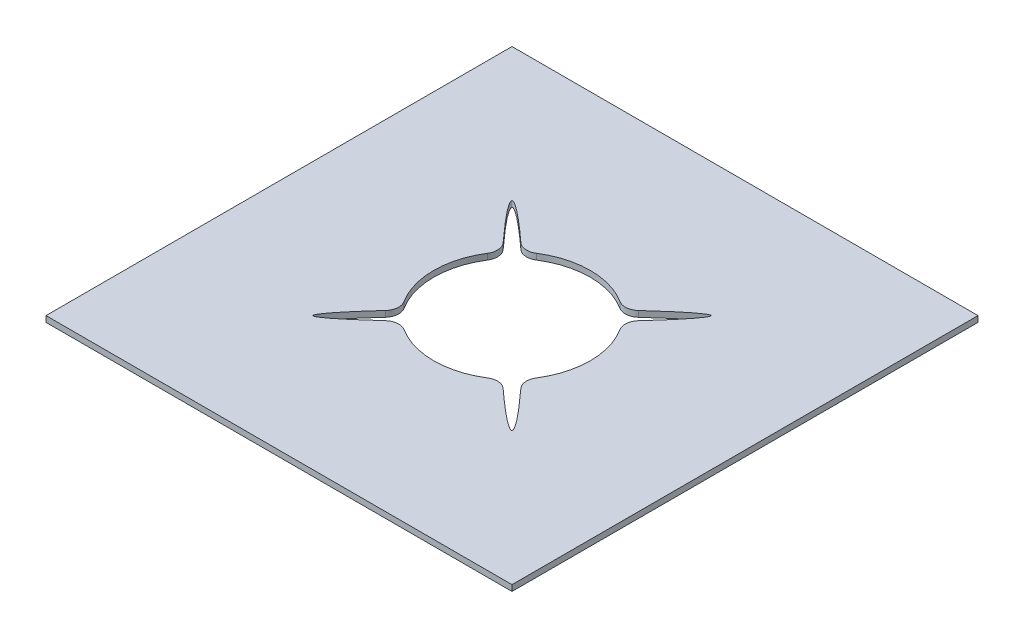
ISO-10303-21;
HEADER;
FILE_DESCRIPTION(('STEP AP214'),'2;1');
FILE_NAME('part.step','',(''),(''),'','','');
FILE_SCHEMA(('AUTOMOTIVE_DESIGN { 1 0 10303 214 1 1 1 1 }'));
ENDSEC;
DATA;
#1=APPLICATION_CONTEXT('core data for automotive mechanical design processes');
#2=APPLICATION_PROTOCOL_DEFINITION('international standard','automotive_design',2000,#1);
#3=PRODUCT_CONTEXT('',#1,'mechanical');
#4=PRODUCT('Part','Part','',(#3));
#5=PRODUCT_RELATED_PRODUCT_CATEGORY('part','',(#4));
#6=PRODUCT_DEFINITION_FORMATION('','',#4);
#7=PRODUCT_DEFINITION_CONTEXT('part definition',#1,'design');
#8=PRODUCT_DEFINITION('design','',#6,#7);
#9=PRODUCT_DEFINITION_SHAPE('','',#8);
#10=(LENGTH_UNIT() NAMED_UNIT(*) SI_UNIT(.MILLI.,.METRE.));
#11=(NAMED_UNIT(*) PLANE_ANGLE_UNIT() SI_UNIT($,.RADIAN.));
#12=(NAMED_UNIT(*) SI_UNIT($,.STERADIAN.) SOLID_ANGLE_UNIT());
#13=UNCERTAINTY_MEASURE_WITH_UNIT(LENGTH_MEASURE(1.E-05),#10,'distance_accuracy_value','');
#14=(GEOMETRIC_REPRESENTATION_CONTEXT(3) GLOBAL_UNCERTAINTY_ASSIGNED_CONTEXT((#13)) GLOBAL_UNIT_ASSIGNED_CONTEXT((#10,
#11,#12)) REPRESENTATION_CONTEXT('',''));
#15=CARTESIAN_POINT('',(0.,0.,0.));
#16=DIRECTION('',(0.,0.,1.));
#17=DIRECTION('',(1.,0.,0.));
#18=AXIS2_PLACEMENT_3D('',#15,#16,#17);
#19=CARTESIAN_POINT('',(0.,6.35,0.));
#20=DIRECTION('',(0.,1.,0.));
#21=DIRECTION('',(0.,0.,1.));
#22=AXIS2_PLACEMENT_3D('',#19,#20,#21);
#23=PLANE('',#22);
#24=DIRECTION('',(0.,0.,1.));
#25=VECTOR('',#24,1.);
#26=CARTESIAN_POINT('',(-229.838709677419,6.35,-211.693548387097));
#27=LINE('',#26,#25);
#28=CARTESIAN_POINT('',(-229.838709677419,6.35,-211.693548387097));
#29=VERTEX_POINT('',#28);
#30=CARTESIAN_POINT('',(-229.838709677419,6.35,288.306451612903));
#31=VERTEX_POINT('',#30);
#32=EDGE_CURVE('E184',#29,#31,#27,.T.);
#33=ORIENTED_EDGE('',*,*,#32,.T.);
#34=DIRECTION('',(1.,0.,0.));
#35=VECTOR('',#34,1.);
#36=CARTESIAN_POINT('',(-229.838709677419,6.35,288.306451612903));
#37=LINE('',#36,#35);
#38=CARTESIAN_POINT('',(270.161290322581,6.35,288.306451612903));
#39=VERTEX_POINT('',#38);
#40=EDGE_CURVE('E173',#31,#39,#37,.T.);
#41=ORIENTED_EDGE('',*,*,#40,.T.);
#42=DIRECTION('',(0.,0.,-1.));
#43=VECTOR('',#42,1.);
#44=CARTESIAN_POINT('',(270.161290322581,6.35,-211.693548387097));
#45=LINE('',#44,#43);
#46=CARTESIAN_POINT('',(270.161290322581,6.35,-211.693548387097));
#47=VERTEX_POINT('',#46);
#48=EDGE_CURVE('E183',#39,#47,#45,.T.);
#49=ORIENTED_EDGE('',*,*,#48,.T.);
#50=DIRECTION('',(-1.,0.,0.));
#51=VECTOR('',#50,1.);
#52=CARTESIAN_POINT('',(-229.838709677419,6.35,-211.693548387097));
#53=LINE('',#52,#51);
#54=EDGE_CURVE('E189',#47,#29,#53,.T.);
#55=ORIENTED_EDGE('',*,*,#54,.T.);
#56=EDGE_LOOP('',(#33,#41,#49,#55));
#57=FACE_BOUND('',#56,.T.);
#58=CARTESIAN_POINT('',(-27.581013578485,6.35,96.6289112448538));
#59=CARTESIAN_POINT('',(-209.618135509777,6.35,268.146429603046));
#60=CARTESIAN_POINT('',(-38.1888727476117,6.35,86.0235671274771));
#61=(BOUNDED_CURVE() B_SPLINE_CURVE(2,(#58,#59,#60),.UNSPECIFIED.,.F.,
.F.) B_SPLINE_CURVE_WITH_KNOTS((3,3),(0.,1.),
.UNSPECIFIED.) CURVE() GEOMETRIC_REPRESENTATION_ITEM() RATIONAL_B_SPLINE_CURVE((1.,
0.436781609195402,1.)) REPRESENTATION_ITEM(''));
#62=CARTESIAN_POINT('',(-42.920621280957,6.35,110.873493927421));
#63=VERTEX_POINT('',#62);
#64=CARTESIAN_POINT('',(-52.41596542798,6.35,101.35928096381));
#65=VERTEX_POINT('',#64);
#66=EDGE_CURVE('E425',#63,#65,#61,.T.);
#67=ORIENTED_EDGE('',*,*,#66,.T.);
#68=CARTESIAN_POINT('',(-63.4946699714491,6.35,91.2467982993737));
#69=DIRECTION('',(0.,1.,0.));
#70=DIRECTION('',(0.,0.,1.));
#71=AXIS2_PLACEMENT_3D('',#68,#69,#70);
#72=CIRCLE('',#71,15.);
#73=CARTESIAN_POINT('',(-50.8195244723537,6.35,83.2255336499085));
#74=VERTEX_POINT('',#73);
#75=EDGE_CURVE('E223',#65,#74,#72,.T.);
#76=ORIENTED_EDGE('',*,*,#75,.T.);
#77=CARTESIAN_POINT('',(20.1612903225808,6.35,38.3064516129032));
#78=DIRECTION('',(0.,1.,0.));
#79=DIRECTION('',(0.,0.,1.));
#80=AXIS2_PLACEMENT_3D('',#77,#78,#79);
#81=CIRCLE('',#80,84.);
#82=CARTESIAN_POINT('',(-50.8067505458124,6.35,-6.63280934343732));
#83=VERTEX_POINT('',#82);
#84=EDGE_CURVE('E390',#83,#74,#81,.T.);
#85=ORIENTED_EDGE('',*,*,#84,.F.);
#86=CARTESIAN_POINT('',(-63.4796149865969,6.35,-14.6576773713553));
#87=DIRECTION('',(0.,1.,0.));
#88=DIRECTION('',(0.,0.,1.));
#89=AXIS2_PLACEMENT_3D('',#86,#87,#88);
#90=CIRCLE('',#89,15.);
#91=CARTESIAN_POINT('',(-52.4057513660394,6.35,-24.775460948468));
#92=VERTEX_POINT('',#91);
#93=EDGE_CURVE('E215',#83,#92,#90,.T.);
#94=ORIENTED_EDGE('',*,*,#93,.T.);
#95=CARTESIAN_POINT('',(-38.1611678084991,6.35,-9.43585228834221));
#96=CARTESIAN_POINT('',(-209.67868616669,6.35,-191.472974219635));
#97=CARTESIAN_POINT('',(-27.5558236911224,6.35,-20.0437114574688));
#98=(BOUNDED_CURVE() B_SPLINE_CURVE(2,(#95,#96,#97),.UNSPECIFIED.,.F.,
.F.) B_SPLINE_CURVE_WITH_KNOTS((3,3),(0.,1.),
.UNSPECIFIED.) CURVE() GEOMETRIC_REPRESENTATION_ITEM() RATIONAL_B_SPLINE_CURVE((1.,
0.436781609195402,1.)) REPRESENTATION_ITEM(''));
#99=CARTESIAN_POINT('',(-42.8915381339252,6.35,-34.2708046914146));
#100=VERTEX_POINT('',#99);
#101=EDGE_CURVE('E420',#92,#100,#98,.T.);
#102=ORIENTED_EDGE('',*,*,#101,.T.);
#103=CARTESIAN_POINT('',(-32.779055477415,6.35,-45.3495092421182));
#104=DIRECTION('',(0.,1.,0.));
#105=DIRECTION('',(0.,0.,1.));
#106=AXIS2_PLACEMENT_3D('',#103,#104,#105);
#107=CIRCLE('',#106,15.);
#108=CARTESIAN_POINT('',(-24.7577909622641,6.35,-32.6743636580241));
#109=VERTEX_POINT('',#108);
#110=EDGE_CURVE('E213',#100,#109,#107,.T.);
#111=ORIENTED_EDGE('',*,*,#110,.T.);
#112=CARTESIAN_POINT('',(65.1005520309861,6.35,-32.6615887792583));
#113=VERTEX_POINT('',#112);
#114=EDGE_CURVE('E386',#113,#109,#81,.T.);
#115=ORIENTED_EDGE('',*,*,#114,.F.);
#116=CARTESIAN_POINT('',(73.1254201932013,6.35,-45.3344531350014));
#117=DIRECTION('',(0.,1.,0.));
#118=DIRECTION('',(0.,0.,1.));
#119=AXIS2_PLACEMENT_3D('',#116,#117,#118);
#120=CIRCLE('',#119,15.);
#121=CARTESIAN_POINT('',(83.243203778244,6.35,-34.2605895216892));
#122=VERTEX_POINT('',#121);
#123=EDGE_CURVE('E211',#113,#122,#120,.T.);
#124=ORIENTED_EDGE('',*,*,#123,.T.);
#125=CARTESIAN_POINT('',(67.9035957246961,6.35,-20.0160065183566));
#126=CARTESIAN_POINT('',(249.940717655987,6.35,-191.53352487655));
#127=CARTESIAN_POINT('',(78.5114548938229,6.35,-9.41066240098003));
#128=(BOUNDED_CURVE() B_SPLINE_CURVE(2,(#125,#126,#127),.UNSPECIFIED.,.F.,
.F.) B_SPLINE_CURVE_WITH_KNOTS((3,3),(0.,1.),
.UNSPECIFIED.) CURVE() GEOMETRIC_REPRESENTATION_ITEM() RATIONAL_B_SPLINE_CURVE((1.,
0.436781609195402,1.)) REPRESENTATION_ITEM(''));
#129=CARTESIAN_POINT('',(92.738547252778,6.35,-24.7463758851894));
#130=VERTEX_POINT('',#129);
#131=EDGE_CURVE('E273',#122,#130,#128,.T.);
#132=ORIENTED_EDGE('',*,*,#131,.T.);
#133=CARTESIAN_POINT('',(103.817251792047,6.35,-14.6338932161517));
#134=DIRECTION('',(0.,1.,0.));
#135=DIRECTION('',(0.,0.,1.));
#136=AXIS2_PLACEMENT_3D('',#133,#134,#135);
#137=CIRCLE('',#136,15.);
#138=CARTESIAN_POINT('',(91.1421061148549,6.35,-6.61262884811308));
#139=VERTEX_POINT('',#138);
#140=EDGE_CURVE('E209',#130,#139,#137,.T.);
#141=ORIENTED_EDGE('',*,*,#140,.T.);
#142=CARTESIAN_POINT('',(91.129331236101,6.35,83.2457124979792));
#143=VERTEX_POINT('',#142);
#144=EDGE_CURVE('E383',#143,#139,#81,.T.);
#145=ORIENTED_EDGE('',*,*,#144,.F.);
#146=CARTESIAN_POINT('',(103.802195684944,6.35,91.2705805131713));
#147=DIRECTION('',(0.,1.,0.));
#148=DIRECTION('',(0.,0.,1.));
#149=AXIS2_PLACEMENT_3D('',#146,#147,#148);
#150=CIRCLE('',#149,15.);
#151=CARTESIAN_POINT('',(92.7283320830704,6.35,101.388364110734));
#152=VERTEX_POINT('',#151);
#153=EDGE_CURVE('E217',#143,#152,#150,.T.);
#154=ORIENTED_EDGE('',*,*,#153,.T.);
#155=CARTESIAN_POINT('',(78.4837499547109,6.35,86.0487570148393));
#156=CARTESIAN_POINT('',(250.001268312903,6.35,268.085878946131));
#157=CARTESIAN_POINT('',(67.8784058373343,6.35,96.656616183966));
#158=(BOUNDED_CURVE() B_SPLINE_CURVE(2,(#155,#156,#157),.UNSPECIFIED.,.F.,
.F.) B_SPLINE_CURVE_WITH_KNOTS((3,3),(0.,1.),
.UNSPECIFIED.) CURVE() GEOMETRIC_REPRESENTATION_ITEM() RATIONAL_B_SPLINE_CURVE((1.,
0.436781609195402,1.)) REPRESENTATION_ITEM(''));
#159=CARTESIAN_POINT('',(83.2141187150734,6.35,110.883707989344));
#160=VERTEX_POINT('',#159);
#161=EDGE_CURVE('E286',#152,#160,#158,.T.);
#162=ORIENTED_EDGE('',*,*,#161,.T.);
#163=CARTESIAN_POINT('',(73.1016360381098,6.35,121.962412521378));
#164=DIRECTION('',(0.,1.,0.));
#165=DIRECTION('',(0.,0.,1.));
#166=AXIS2_PLACEMENT_3D('',#163,#164,#165);
#167=CIRCLE('',#166,15.);
#168=CARTESIAN_POINT('',(65.080371535757,6.35,109.287266929185));
#169=VERTEX_POINT('',#168);
#170=EDGE_CURVE('E219',#160,#169,#167,.T.);
#171=ORIENTED_EDGE('',*,*,#170,.T.);
#172=CARTESIAN_POINT('',(-24.7779698104299,6.35,109.274493002655));
#173=VERTEX_POINT('',#172);
#174=EDGE_CURVE('E385',#173,#169,#81,.T.);
#175=ORIENTED_EDGE('',*,*,#174,.F.);
#176=CARTESIAN_POINT('',(-32.8028376913247,6.35,121.94735753654));
#177=DIRECTION('',(0.,1.,0.));
#178=DIRECTION('',(0.,0.,1.));
#179=AXIS2_PLACEMENT_3D('',#176,#177,#178);
#180=CIRCLE('',#179,15.);
#181=EDGE_CURVE('E221',#173,#63,#180,.T.);
#182=ORIENTED_EDGE('',*,*,#181,.T.);
#183=EDGE_LOOP('',(#67,#76,#85,#94,#102,#111,#115,#124,#132,#141,#145,#154,#162,#171,#175,#182));
#184=FACE_BOUND('',#183,.T.);
#185=ADVANCED_FACE('F35',(#57,#184),#23,.T.);
#186=CARTESIAN_POINT('',(0.,0.,0.));
#187=DIRECTION('',(0.,1.,0.));
#188=DIRECTION('',(0.,0.,1.));
#189=AXIS2_PLACEMENT_3D('',#186,#187,#188);
#190=PLANE('',#189);
#191=DIRECTION('',(0.,0.,1.));
#192=VECTOR('',#191,1.);
#193=CARTESIAN_POINT('',(-229.838709677419,0.,-211.693548387097));
#194=LINE('',#193,#192);
#195=CARTESIAN_POINT('',(-229.838709677419,0.,-211.693548387097));
#196=VERTEX_POINT('',#195);
#197=CARTESIAN_POINT('',(-229.838709677419,0.,288.306451612903));
#198=VERTEX_POINT('',#197);
#199=EDGE_CURVE('E197',#196,#198,#194,.T.);
#200=ORIENTED_EDGE('',*,*,#199,.F.);
#201=DIRECTION('',(-1.,0.,0.));
#202=VECTOR('',#201,1.);
#203=CARTESIAN_POINT('',(-229.838709677419,0.,-211.693548387097));
#204=LINE('',#203,#202);
#205=CARTESIAN_POINT('',(270.161290322581,0.,-211.693548387097));
#206=VERTEX_POINT('',#205);
#207=EDGE_CURVE('E193',#206,#196,#204,.T.);
#208=ORIENTED_EDGE('',*,*,#207,.F.);
#209=DIRECTION('',(0.,0.,-1.));
#210=VECTOR('',#209,1.);
#211=CARTESIAN_POINT('',(270.161290322581,0.,-211.693548387097));
#212=LINE('',#211,#210);
#213=CARTESIAN_POINT('',(270.161290322581,0.,288.306451612903));
#214=VERTEX_POINT('',#213);
#215=EDGE_CURVE('E401',#214,#206,#212,.T.);
#216=ORIENTED_EDGE('',*,*,#215,.F.);
#217=DIRECTION('',(1.,0.,0.));
#218=VECTOR('',#217,1.);
#219=CARTESIAN_POINT('',(-229.838709677419,0.,288.306451612903));
#220=LINE('',#219,#218);
#221=EDGE_CURVE('E398',#198,#214,#220,.T.);
#222=ORIENTED_EDGE('',*,*,#221,.F.);
#223=EDGE_LOOP('',(#200,#208,#216,#222));
#224=FACE_BOUND('',#223,.T.);
#225=CARTESIAN_POINT('',(20.1612903225808,0.,38.3064516129032));
#226=DIRECTION('',(0.,1.,0.));
#227=DIRECTION('',(0.,0.,1.));
#228=AXIS2_PLACEMENT_3D('',#225,#226,#227);
#229=CIRCLE('',#228,84.);
#230=CARTESIAN_POINT('',(-50.8067505458124,0.,-6.63280934343732));
#231=VERTEX_POINT('',#230);
#232=CARTESIAN_POINT('',(-50.8195244723537,0.,83.2255336499085));
#233=VERTEX_POINT('',#232);
#234=EDGE_CURVE('E389',#231,#233,#229,.T.);
#235=ORIENTED_EDGE('',*,*,#234,.T.);
#236=CARTESIAN_POINT('',(-63.4946699714491,0.,91.2467982993737));
#237=DIRECTION('',(0.,1.,0.));
#238=DIRECTION('',(0.,0.,1.));
#239=AXIS2_PLACEMENT_3D('',#236,#237,#238);
#240=CIRCLE('',#239,15.);
#241=CARTESIAN_POINT('',(-52.41596542798,0.,101.35928096381));
#242=VERTEX_POINT('',#241);
#243=EDGE_CURVE('E242',#233,#242,#240,.F.);
#244=ORIENTED_EDGE('',*,*,#243,.T.);
#245=CARTESIAN_POINT('',(-27.581013578485,0.,96.6289112448538));
#246=CARTESIAN_POINT('',(-209.618135509777,0.,268.146429603046));
#247=CARTESIAN_POINT('',(-38.1888727476117,0.,86.0235671274771));
#248=(BOUNDED_CURVE() B_SPLINE_CURVE(2,(#245,#246,#247),.UNSPECIFIED.,.F.,
.F.) B_SPLINE_CURVE_WITH_KNOTS((3,3),(0.,1.),
.UNSPECIFIED.) CURVE() GEOMETRIC_REPRESENTATION_ITEM() RATIONAL_B_SPLINE_CURVE((1.,
0.436781609195402,1.)) REPRESENTATION_ITEM(''));
#249=CARTESIAN_POINT('',(-42.920621280957,0.,110.873493927421));
#250=VERTEX_POINT('',#249);
#251=EDGE_CURVE('E302',#250,#242,#248,.T.);
#252=ORIENTED_EDGE('',*,*,#251,.F.);
#253=CARTESIAN_POINT('',(-32.8028376913247,0.,121.94735753654));
#254=DIRECTION('',(0.,1.,0.));
#255=DIRECTION('',(0.,0.,1.));
#256=AXIS2_PLACEMENT_3D('',#253,#254,#255);
#257=CIRCLE('',#256,15.);
#258=CARTESIAN_POINT('',(-24.7779698104299,0.,109.274493002655));
#259=VERTEX_POINT('',#258);
#260=EDGE_CURVE('E240',#250,#259,#257,.F.);
#261=ORIENTED_EDGE('',*,*,#260,.T.);
#262=CARTESIAN_POINT('',(65.080371535757,0.,109.287266929185));
#263=VERTEX_POINT('',#262);
#264=EDGE_CURVE('E399',#259,#263,#229,.T.);
#265=ORIENTED_EDGE('',*,*,#264,.T.);
#266=CARTESIAN_POINT('',(73.1016360381098,0.,121.962412521378));
#267=DIRECTION('',(0.,1.,0.));
#268=DIRECTION('',(0.,0.,1.));
#269=AXIS2_PLACEMENT_3D('',#266,#267,#268);
#270=CIRCLE('',#269,15.);
#271=CARTESIAN_POINT('',(83.2141187150733,0.,110.883707989344));
#272=VERTEX_POINT('',#271);
#273=EDGE_CURVE('E238',#263,#272,#270,.F.);
#274=ORIENTED_EDGE('',*,*,#273,.T.);
#275=CARTESIAN_POINT('',(78.4837499547109,0.,86.0487570148393));
#276=CARTESIAN_POINT('',(250.001268312903,0.,268.085878946131));
#277=CARTESIAN_POINT('',(67.8784058373343,0.,96.656616183966));
#278=(BOUNDED_CURVE() B_SPLINE_CURVE(2,(#275,#276,#277),.UNSPECIFIED.,.F.,
.F.) B_SPLINE_CURVE_WITH_KNOTS((3,3),(0.,1.),
.UNSPECIFIED.) CURVE() GEOMETRIC_REPRESENTATION_ITEM() RATIONAL_B_SPLINE_CURVE((1.,
0.436781609195402,1.)) REPRESENTATION_ITEM(''));
#279=CARTESIAN_POINT('',(92.7283320830704,0.,101.388364110734));
#280=VERTEX_POINT('',#279);
#281=EDGE_CURVE('E283',#280,#272,#278,.T.);
#282=ORIENTED_EDGE('',*,*,#281,.F.);
#283=CARTESIAN_POINT('',(103.802195684944,0.,91.2705805131713));
#284=DIRECTION('',(0.,1.,0.));
#285=DIRECTION('',(0.,0.,1.));
#286=AXIS2_PLACEMENT_3D('',#283,#284,#285);
#287=CIRCLE('',#286,15.);
#288=CARTESIAN_POINT('',(91.129331236101,0.,83.2457124979792));
#289=VERTEX_POINT('',#288);
#290=EDGE_CURVE('E236',#280,#289,#287,.F.);
#291=ORIENTED_EDGE('',*,*,#290,.T.);
#292=CARTESIAN_POINT('',(91.1421061148549,0.,-6.61262884811308));
#293=VERTEX_POINT('',#292);
#294=EDGE_CURVE('E378',#289,#293,#229,.T.);
#295=ORIENTED_EDGE('',*,*,#294,.T.);
#296=CARTESIAN_POINT('',(103.817251792047,0.,-14.6338932161517));
#297=DIRECTION('',(0.,1.,0.));
#298=DIRECTION('',(0.,0.,1.));
#299=AXIS2_PLACEMENT_3D('',#296,#297,#298);
#300=CIRCLE('',#299,15.);
#301=CARTESIAN_POINT('',(92.738547252778,0.,-24.7463758851894));
#302=VERTEX_POINT('',#301);
#303=EDGE_CURVE('E229',#293,#302,#300,.F.);
#304=ORIENTED_EDGE('',*,*,#303,.T.);
#305=CARTESIAN_POINT('',(67.9035957246961,0.,-20.0160065183566));
#306=CARTESIAN_POINT('',(249.940717655987,0.,-191.53352487655));
#307=CARTESIAN_POINT('',(78.5114548938229,0.,-9.41066240098003));
#308=(BOUNDED_CURVE() B_SPLINE_CURVE(2,(#305,#306,#307),.UNSPECIFIED.,.F.,
.F.) B_SPLINE_CURVE_WITH_KNOTS((3,3),(0.,1.),
.UNSPECIFIED.) CURVE() GEOMETRIC_REPRESENTATION_ITEM() RATIONAL_B_SPLINE_CURVE((1.,
0.436781609195402,1.)) REPRESENTATION_ITEM(''));
#309=CARTESIAN_POINT('',(83.243203778244,0.,-34.2605895216892));
#310=VERTEX_POINT('',#309);
#311=EDGE_CURVE('E275',#310,#302,#308,.T.);
#312=ORIENTED_EDGE('',*,*,#311,.F.);
#313=CARTESIAN_POINT('',(73.1254201932013,0.,-45.3344531350014));
#314=DIRECTION('',(0.,1.,0.));
#315=DIRECTION('',(0.,0.,1.));
#316=AXIS2_PLACEMENT_3D('',#313,#314,#315);
#317=CIRCLE('',#316,15.);
#318=CARTESIAN_POINT('',(65.1005520309861,0.,-32.6615887792583));
#319=VERTEX_POINT('',#318);
#320=EDGE_CURVE('E57',#310,#319,#317,.F.);
#321=ORIENTED_EDGE('',*,*,#320,.T.);
#322=CARTESIAN_POINT('',(-24.7577909622641,0.,-32.6743636580241));
#323=VERTEX_POINT('',#322);
#324=EDGE_CURVE('E392',#319,#323,#229,.T.);
#325=ORIENTED_EDGE('',*,*,#324,.T.);
#326=CARTESIAN_POINT('',(-32.779055477415,0.,-45.3495092421182));
#327=DIRECTION('',(0.,1.,0.));
#328=DIRECTION('',(0.,0.,1.));
#329=AXIS2_PLACEMENT_3D('',#326,#327,#328);
#330=CIRCLE('',#329,15.);
#331=CARTESIAN_POINT('',(-42.8915381339252,0.,-34.2708046914146));
#332=VERTEX_POINT('',#331);
#333=EDGE_CURVE('E232',#323,#332,#330,.F.);
#334=ORIENTED_EDGE('',*,*,#333,.T.);
#335=CARTESIAN_POINT('',(-38.1611678084991,0.,-9.43585228834221));
#336=CARTESIAN_POINT('',(-209.67868616669,0.,-191.472974219635));
#337=CARTESIAN_POINT('',(-27.5558236911224,0.,-20.0437114574688));
#338=(BOUNDED_CURVE() B_SPLINE_CURVE(2,(#335,#336,#337),.UNSPECIFIED.,.F.,
.F.) B_SPLINE_CURVE_WITH_KNOTS((3,3),(0.,1.),
.UNSPECIFIED.) CURVE() GEOMETRIC_REPRESENTATION_ITEM() RATIONAL_B_SPLINE_CURVE((1.,
0.436781609195402,1.)) REPRESENTATION_ITEM(''));
#339=CARTESIAN_POINT('',(-52.4057513660394,0.,-24.775460948468));
#340=VERTEX_POINT('',#339);
#341=EDGE_CURVE('E422',#340,#332,#338,.T.);
#342=ORIENTED_EDGE('',*,*,#341,.F.);
#343=CARTESIAN_POINT('',(-63.4796149865969,0.,-14.6576773713553));
#344=DIRECTION('',(0.,1.,0.));
#345=DIRECTION('',(0.,0.,1.));
#346=AXIS2_PLACEMENT_3D('',#343,#344,#345);
#347=CIRCLE('',#346,15.);
#348=EDGE_CURVE('E234',#340,#231,#347,.F.);
#349=ORIENTED_EDGE('',*,*,#348,.T.);
#350=EDGE_LOOP('',(#235,#244,#252,#261,#265,#274,#282,#291,#295,#304,#312,#321,#325,#334,#342,#349));
#351=FACE_BOUND('',#350,.T.);
#352=ADVANCED_FACE('F325',(#224,#351),#190,.F.);
#353=CARTESIAN_POINT('',(20.1612903225808,0.,38.3064516129032));
#354=DIRECTION('',(0.,1.,0.));
#355=DIRECTION('',(0.,0.,1.));
#356=AXIS2_PLACEMENT_3D('',#353,#354,#355);
#357=CYLINDRICAL_SURFACE('',#356,84.);
#358=ORIENTED_EDGE('',*,*,#84,.T.);
#359=DIRECTION('',(0.,1.,0.));
#360=VECTOR('',#359,1.);
#361=CARTESIAN_POINT('',(-50.8195244723537,0.,83.2255336499085));
#362=LINE('',#361,#360);
#363=EDGE_CURVE('E227',#74,#233,#362,.F.);
#364=ORIENTED_EDGE('',*,*,#363,.T.);
#365=ORIENTED_EDGE('',*,*,#234,.F.);
#366=DIRECTION('',(0.,1.,0.));
#367=VECTOR('',#366,1.);
#368=CARTESIAN_POINT('',(-50.8067505458124,0.,-6.63280934343733));
#369=LINE('',#368,#367);
#370=EDGE_CURVE('E225',#231,#83,#369,.T.);
#371=ORIENTED_EDGE('',*,*,#370,.T.);
#372=EDGE_LOOP('',(#358,#364,#365,#371));
#373=FACE_BOUND('',#372,.T.);
#374=ADVANCED_FACE('F321',(#373),#357,.F.);
#375=ORIENTED_EDGE('',*,*,#114,.T.);
#376=DIRECTION('',(0.,1.,0.));
#377=VECTOR('',#376,1.);
#378=CARTESIAN_POINT('',(-24.7577909622641,0.,-32.6743636580241));
#379=LINE('',#378,#377);
#380=EDGE_CURVE('E50',#109,#323,#379,.F.);
#381=ORIENTED_EDGE('',*,*,#380,.T.);
#382=ORIENTED_EDGE('',*,*,#324,.F.);
#383=DIRECTION('',(0.,1.,0.));
#384=VECTOR('',#383,1.);
#385=CARTESIAN_POINT('',(65.1005520309861,0.,-32.6615887792583));
#386=LINE('',#385,#384);
#387=EDGE_CURVE('E264',#319,#113,#386,.T.);
#388=ORIENTED_EDGE('',*,*,#387,.T.);
#389=EDGE_LOOP('',(#375,#381,#382,#388));
#390=FACE_BOUND('',#389,.T.);
#391=ADVANCED_FACE('F324',(#390),#357,.F.);
#392=ORIENTED_EDGE('',*,*,#294,.F.);
#393=DIRECTION('',(0.,1.,0.));
#394=VECTOR('',#393,1.);
#395=CARTESIAN_POINT('',(91.129331236101,0.,83.2457124979792));
#396=LINE('',#395,#394);
#397=EDGE_CURVE('E256',#289,#143,#396,.T.);
#398=ORIENTED_EDGE('',*,*,#397,.T.);
#399=ORIENTED_EDGE('',*,*,#144,.T.);
#400=DIRECTION('',(0.,1.,0.));
#401=VECTOR('',#400,1.);
#402=CARTESIAN_POINT('',(91.1421061148549,0.,-6.61262884811308));
#403=LINE('',#402,#401);
#404=EDGE_CURVE('E254',#139,#293,#403,.F.);
#405=ORIENTED_EDGE('',*,*,#404,.T.);
#406=EDGE_LOOP('',(#392,#398,#399,#405));
#407=FACE_BOUND('',#406,.T.);
#408=ADVANCED_FACE('F381',(#407),#357,.F.);
#409=ORIENTED_EDGE('',*,*,#264,.F.);
#410=DIRECTION('',(0.,1.,0.));
#411=VECTOR('',#410,1.);
#412=CARTESIAN_POINT('',(-24.7779698104299,0.,109.274493002655));
#413=LINE('',#412,#411);
#414=EDGE_CURVE('E246',#259,#173,#413,.T.);
#415=ORIENTED_EDGE('',*,*,#414,.T.);
#416=ORIENTED_EDGE('',*,*,#174,.T.);
#417=DIRECTION('',(0.,1.,0.));
#418=VECTOR('',#417,1.);
#419=CARTESIAN_POINT('',(65.080371535757,0.,109.287266929185));
#420=LINE('',#419,#418);
#421=EDGE_CURVE('E244',#169,#263,#420,.F.);
#422=ORIENTED_EDGE('',*,*,#421,.T.);
#423=EDGE_LOOP('',(#409,#415,#416,#422));
#424=FACE_BOUND('',#423,.T.);
#425=ADVANCED_FACE('F327',(#424),#357,.F.);
#426=CARTESIAN_POINT('',(-229.838709677419,6.35,-211.693548387097));
#427=DIRECTION('',(1.,0.,0.));
#428=DIRECTION('',(0.,0.,-1.));
#429=AXIS2_PLACEMENT_3D('',#426,#427,#428);
#430=PLANE('',#429);
#431=ORIENTED_EDGE('',*,*,#199,.T.);
#432=DIRECTION('',(0.,-1.,0.));
#433=VECTOR('',#432,1.);
#434=CARTESIAN_POINT('',(-229.838709677419,6.35,288.306451612903));
#435=LINE('',#434,#433);
#436=EDGE_CURVE('E177',#31,#198,#435,.T.);
#437=ORIENTED_EDGE('',*,*,#436,.F.);
#438=ORIENTED_EDGE('',*,*,#32,.F.);
#439=DIRECTION('',(0.,-1.,0.));
#440=VECTOR('',#439,1.);
#441=CARTESIAN_POINT('',(-229.838709677419,6.35,-211.693548387097));
#442=LINE('',#441,#440);
#443=EDGE_CURVE('E396',#29,#196,#442,.T.);
#444=ORIENTED_EDGE('',*,*,#443,.T.);
#445=EDGE_LOOP('',(#431,#437,#438,#444));
#446=FACE_BOUND('',#445,.T.);
#447=ADVANCED_FACE('F195',(#446),#430,.F.);
#448=CARTESIAN_POINT('',(-229.838709677419,6.35,288.306451612903));
#449=DIRECTION('',(0.,0.,-1.));
#450=DIRECTION('',(-1.,0.,0.));
#451=AXIS2_PLACEMENT_3D('',#448,#449,#450);
#452=PLANE('',#451);
#453=ORIENTED_EDGE('',*,*,#221,.T.);
#454=DIRECTION('',(0.,-1.,0.));
#455=VECTOR('',#454,1.);
#456=CARTESIAN_POINT('',(270.161290322581,6.35,288.306451612903));
#457=LINE('',#456,#455);
#458=EDGE_CURVE('E180',#39,#214,#457,.T.);
#459=ORIENTED_EDGE('',*,*,#458,.F.);
#460=ORIENTED_EDGE('',*,*,#40,.F.);
#461=ORIENTED_EDGE('',*,*,#436,.T.);
#462=EDGE_LOOP('',(#453,#459,#460,#461));
#463=FACE_BOUND('',#462,.T.);
#464=ADVANCED_FACE('F175',(#463),#452,.F.);
#465=CARTESIAN_POINT('',(270.161290322581,6.35,-211.693548387097));
#466=DIRECTION('',(-1.,0.,0.));
#467=DIRECTION('',(0.,0.,1.));
#468=AXIS2_PLACEMENT_3D('',#465,#466,#467);
#469=PLANE('',#468);
#470=ORIENTED_EDGE('',*,*,#215,.T.);
#471=DIRECTION('',(0.,-1.,0.));
#472=VECTOR('',#471,1.);
#473=CARTESIAN_POINT('',(270.161290322581,6.35,-211.693548387097));
#474=LINE('',#473,#472);
#475=EDGE_CURVE('E203',#47,#206,#474,.T.);
#476=ORIENTED_EDGE('',*,*,#475,.F.);
#477=ORIENTED_EDGE('',*,*,#48,.F.);
#478=ORIENTED_EDGE('',*,*,#458,.T.);
#479=EDGE_LOOP('',(#470,#476,#477,#478));
#480=FACE_BOUND('',#479,.T.);
#481=ADVANCED_FACE('F335',(#480),#469,.F.);
#482=CARTESIAN_POINT('',(-229.838709677419,6.35,-211.693548387097));
#483=DIRECTION('',(0.,0.,1.));
#484=DIRECTION('',(1.,0.,0.));
#485=AXIS2_PLACEMENT_3D('',#482,#483,#484);
#486=PLANE('',#485);
#487=ORIENTED_EDGE('',*,*,#207,.T.);
#488=ORIENTED_EDGE('',*,*,#443,.F.);
#489=ORIENTED_EDGE('',*,*,#54,.F.);
#490=ORIENTED_EDGE('',*,*,#475,.T.);
#491=EDGE_LOOP('',(#487,#488,#489,#490));
#492=FACE_BOUND('',#491,.T.);
#493=ADVANCED_FACE('F319',(#492),#486,.F.);
#494=DIRECTION('',(0.,1.,0.));
#495=VECTOR('',#494,1.);
#496=SURFACE_OF_LINEAR_EXTRUSION('',#248,#495);
#497=ORIENTED_EDGE('',*,*,#251,.T.);
#498=DIRECTION('',(0.,1.,0.));
#499=VECTOR('',#498,1.);
#500=CARTESIAN_POINT('',(-52.41596542798,0.,101.35928096381));
#501=LINE('',#500,#499);
#502=EDGE_CURVE('E201',#242,#65,#501,.T.);
#503=ORIENTED_EDGE('',*,*,#502,.T.);
#504=ORIENTED_EDGE('',*,*,#66,.F.);
#505=DIRECTION('',(0.,1.,0.));
#506=VECTOR('',#505,1.);
#507=CARTESIAN_POINT('',(-42.920621280957,6.35,110.873493927421));
#508=LINE('',#507,#506);
#509=EDGE_CURVE('E198',#63,#250,#508,.F.);
#510=ORIENTED_EDGE('',*,*,#509,.T.);
#511=EDGE_LOOP('',(#497,#503,#504,#510));
#512=FACE_BOUND('',#511,.T.);
#513=ADVANCED_FACE('F315',(#512),#496,.T.);
#514=DIRECTION('',(0.,1.,0.));
#515=VECTOR('',#514,1.);
#516=SURFACE_OF_LINEAR_EXTRUSION('',#308,#515);
#517=ORIENTED_EDGE('',*,*,#131,.F.);
#518=DIRECTION('',(0.,1.,0.));
#519=VECTOR('',#518,1.);
#520=CARTESIAN_POINT('',(83.243203778244,6.35,-34.2605895216892));
#521=LINE('',#520,#519);
#522=EDGE_CURVE('E11',#122,#310,#521,.F.);
#523=ORIENTED_EDGE('',*,*,#522,.T.);
#524=ORIENTED_EDGE('',*,*,#311,.T.);
#525=DIRECTION('',(0.,1.,0.));
#526=VECTOR('',#525,1.);
#527=CARTESIAN_POINT('',(92.738547252778,0.,-24.7463758851894));
#528=LINE('',#527,#526);
#529=EDGE_CURVE('E43',#302,#130,#528,.T.);
#530=ORIENTED_EDGE('',*,*,#529,.T.);
#531=EDGE_LOOP('',(#517,#523,#524,#530));
#532=FACE_BOUND('',#531,.T.);
#533=ADVANCED_FACE('F272',(#532),#516,.T.);
#534=DIRECTION('',(0.,1.,0.));
#535=VECTOR('',#534,1.);
#536=SURFACE_OF_LINEAR_EXTRUSION('',#278,#535);
#537=ORIENTED_EDGE('',*,*,#281,.T.);
#538=DIRECTION('',(0.,1.,0.));
#539=VECTOR('',#538,1.);
#540=CARTESIAN_POINT('',(83.2141187150734,0.,110.883707989344));
#541=LINE('',#540,#539);
#542=EDGE_CURVE('E251',#272,#160,#541,.T.);
#543=ORIENTED_EDGE('',*,*,#542,.T.);
#544=ORIENTED_EDGE('',*,*,#161,.F.);
#545=DIRECTION('',(0.,1.,0.));
#546=VECTOR('',#545,1.);
#547=CARTESIAN_POINT('',(92.7283320830704,6.35,101.388364110734));
#548=LINE('',#547,#546);
#549=EDGE_CURVE('E248',#152,#280,#548,.F.);
#550=ORIENTED_EDGE('',*,*,#549,.T.);
#551=EDGE_LOOP('',(#537,#543,#544,#550));
#552=FACE_BOUND('',#551,.T.);
#553=ADVANCED_FACE('F314',(#552),#536,.T.);
#554=DIRECTION('',(0.,1.,0.));
#555=VECTOR('',#554,1.);
#556=SURFACE_OF_LINEAR_EXTRUSION('',#338,#555);
#557=ORIENTED_EDGE('',*,*,#101,.F.);
#558=DIRECTION('',(0.,1.,0.));
#559=VECTOR('',#558,1.);
#560=CARTESIAN_POINT('',(-52.4057513660394,6.35,-24.775460948468));
#561=LINE('',#560,#559);
#562=EDGE_CURVE('E261',#92,#340,#561,.F.);
#563=ORIENTED_EDGE('',*,*,#562,.T.);
#564=ORIENTED_EDGE('',*,*,#341,.T.);
#565=DIRECTION('',(0.,1.,0.));
#566=VECTOR('',#565,1.);
#567=CARTESIAN_POINT('',(-42.8915381339251,0.,-34.2708046914146));
#568=LINE('',#567,#566);
#569=EDGE_CURVE('E258',#332,#100,#568,.T.);
#570=ORIENTED_EDGE('',*,*,#569,.T.);
#571=EDGE_LOOP('',(#557,#563,#564,#570));
#572=FACE_BOUND('',#571,.T.);
#573=ADVANCED_FACE('F348',(#572),#556,.T.);
#574=CARTESIAN_POINT('',(-63.4946699714491,3.175,91.2467982993737));
#575=DIRECTION('',(0.,1.,0.));
#576=DIRECTION('',(0.,0.,1.));
#577=AXIS2_PLACEMENT_3D('',#574,#575,#576);
#578=CYLINDRICAL_SURFACE('',#577,15.);
#579=ORIENTED_EDGE('',*,*,#243,.F.);
#580=ORIENTED_EDGE('',*,*,#363,.F.);
#581=ORIENTED_EDGE('',*,*,#75,.F.);
#582=ORIENTED_EDGE('',*,*,#502,.F.);
#583=EDGE_LOOP('',(#579,#580,#581,#582));
#584=FACE_BOUND('',#583,.T.);
#585=ADVANCED_FACE('F344',(#584),#578,.T.);
#586=CARTESIAN_POINT('',(-32.8028376913247,3.175,121.94735753654));
#587=DIRECTION('',(0.,1.,0.));
#588=DIRECTION('',(0.,0.,1.));
#589=AXIS2_PLACEMENT_3D('',#586,#587,#588);
#590=CYLINDRICAL_SURFACE('',#589,15.);
#591=ORIENTED_EDGE('',*,*,#181,.F.);
#592=ORIENTED_EDGE('',*,*,#414,.F.);
#593=ORIENTED_EDGE('',*,*,#260,.F.);
#594=ORIENTED_EDGE('',*,*,#509,.F.);
#595=EDGE_LOOP('',(#591,#592,#593,#594));
#596=FACE_BOUND('',#595,.T.);
#597=ADVANCED_FACE('F347',(#596),#590,.T.);
#598=CARTESIAN_POINT('',(73.1016360381098,3.175,121.962412521378));
#599=DIRECTION('',(0.,1.,0.));
#600=DIRECTION('',(0.,0.,1.));
#601=AXIS2_PLACEMENT_3D('',#598,#599,#600);
#602=CYLINDRICAL_SURFACE('',#601,15.);
#603=ORIENTED_EDGE('',*,*,#273,.F.);
#604=ORIENTED_EDGE('',*,*,#421,.F.);
#605=ORIENTED_EDGE('',*,*,#170,.F.);
#606=ORIENTED_EDGE('',*,*,#542,.F.);
#607=EDGE_LOOP('',(#603,#604,#605,#606));
#608=FACE_BOUND('',#607,.T.);
#609=ADVANCED_FACE('F352',(#608),#602,.T.);
#610=CARTESIAN_POINT('',(103.802195684944,3.175,91.2705805131713));
#611=DIRECTION('',(0.,1.,0.));
#612=DIRECTION('',(0.,0.,1.));
#613=AXIS2_PLACEMENT_3D('',#610,#611,#612);
#614=CYLINDRICAL_SURFACE('',#613,15.);
#615=ORIENTED_EDGE('',*,*,#153,.F.);
#616=ORIENTED_EDGE('',*,*,#397,.F.);
#617=ORIENTED_EDGE('',*,*,#290,.F.);
#618=ORIENTED_EDGE('',*,*,#549,.F.);
#619=EDGE_LOOP('',(#615,#616,#617,#618));
#620=FACE_BOUND('',#619,.T.);
#621=ADVANCED_FACE('F356',(#620),#614,.T.);
#622=CARTESIAN_POINT('',(-63.4796149865969,3.175,-14.6576773713553));
#623=DIRECTION('',(0.,1.,0.));
#624=DIRECTION('',(0.,0.,1.));
#625=AXIS2_PLACEMENT_3D('',#622,#623,#624);
#626=CYLINDRICAL_SURFACE('',#625,15.);
#627=ORIENTED_EDGE('',*,*,#93,.F.);
#628=ORIENTED_EDGE('',*,*,#370,.F.);
#629=ORIENTED_EDGE('',*,*,#348,.F.);
#630=ORIENTED_EDGE('',*,*,#562,.F.);
#631=EDGE_LOOP('',(#627,#628,#629,#630));
#632=FACE_BOUND('',#631,.T.);
#633=ADVANCED_FACE('F360',(#632),#626,.T.);
#634=CARTESIAN_POINT('',(-32.779055477415,3.175,-45.3495092421182));
#635=DIRECTION('',(0.,1.,0.));
#636=DIRECTION('',(0.,0.,1.));
#637=AXIS2_PLACEMENT_3D('',#634,#635,#636);
#638=CYLINDRICAL_SURFACE('',#637,15.);
#639=ORIENTED_EDGE('',*,*,#333,.F.);
#640=ORIENTED_EDGE('',*,*,#380,.F.);
#641=ORIENTED_EDGE('',*,*,#110,.F.);
#642=ORIENTED_EDGE('',*,*,#569,.F.);
#643=EDGE_LOOP('',(#639,#640,#641,#642));
#644=FACE_BOUND('',#643,.T.);
#645=ADVANCED_FACE('F364',(#644),#638,.T.);
#646=CARTESIAN_POINT('',(73.1254201932013,3.175,-45.3344531350014));
#647=DIRECTION('',(0.,1.,0.));
#648=DIRECTION('',(0.,0.,1.));
#649=AXIS2_PLACEMENT_3D('',#646,#647,#648);
#650=CYLINDRICAL_SURFACE('',#649,15.);
#651=ORIENTED_EDGE('',*,*,#123,.F.);
#652=ORIENTED_EDGE('',*,*,#387,.F.);
#653=ORIENTED_EDGE('',*,*,#320,.F.);
#654=ORIENTED_EDGE('',*,*,#522,.F.);
#655=EDGE_LOOP('',(#651,#652,#653,#654));
#656=FACE_BOUND('',#655,.T.);
#657=ADVANCED_FACE('F367',(#656),#650,.T.);
#658=CARTESIAN_POINT('',(103.817251792047,3.175,-14.6338932161517));
#659=DIRECTION('',(0.,1.,0.));
#660=DIRECTION('',(0.,0.,1.));
#661=AXIS2_PLACEMENT_3D('',#658,#659,#660);
#662=CYLINDRICAL_SURFACE('',#661,15.);
#663=ORIENTED_EDGE('',*,*,#303,.F.);
#664=ORIENTED_EDGE('',*,*,#404,.F.);
#665=ORIENTED_EDGE('',*,*,#140,.F.);
#666=ORIENTED_EDGE('',*,*,#529,.F.);
#667=EDGE_LOOP('',(#663,#664,#665,#666));
#668=FACE_BOUND('',#667,.T.);
#669=ADVANCED_FACE('F37',(#668),#662,.T.);
#670=CLOSED_SHELL('',(#185,#352,#374,#391,#408,#425,#447,#464,#481,#493,#513,#533,#553,#573,
#585,#597,#609,#621,#633,#645,#657,#669));
#671=MANIFOLD_SOLID_BREP('B2',#670);
#672=ADVANCED_BREP_SHAPE_REPRESENTATION('',(#18,#671),#14);
#673=SHAPE_DEFINITION_REPRESENTATION(#9,#672);
ENDSEC;
END-ISO-10303-21;
